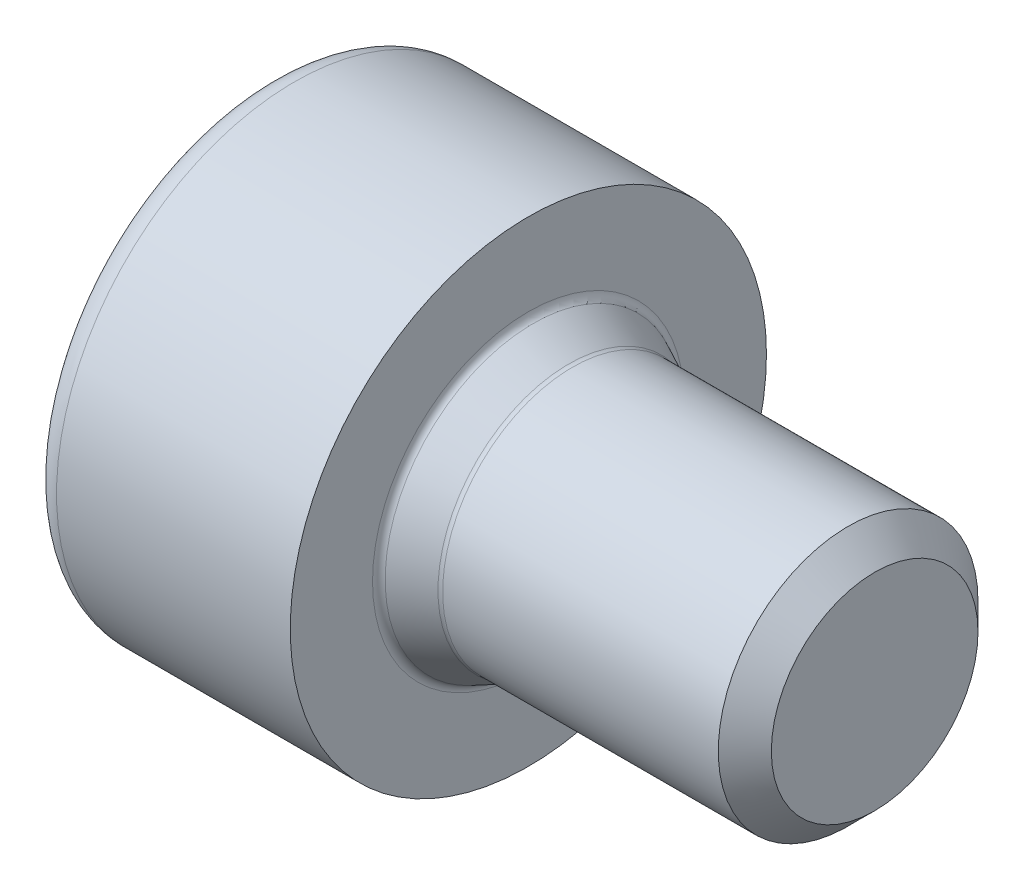
ISO-10303-21;
HEADER;
FILE_DESCRIPTION(('STEP AP214'),'2;1');
FILE_NAME('part.step','',(''),(''),'','','');
FILE_SCHEMA(('AUTOMOTIVE_DESIGN { 1 0 10303 214 1 1 1 1 }'));
ENDSEC;
DATA;
#1=APPLICATION_CONTEXT('core data for automotive mechanical design processes');
#2=APPLICATION_PROTOCOL_DEFINITION('international standard','automotive_design',2000,#1);
#3=PRODUCT_CONTEXT('',#1,'mechanical');
#4=PRODUCT('Part','Part','',(#3));
#5=PRODUCT_RELATED_PRODUCT_CATEGORY('part','',(#4));
#6=PRODUCT_DEFINITION_FORMATION('','',#4);
#7=PRODUCT_DEFINITION_CONTEXT('part definition',#1,'design');
#8=PRODUCT_DEFINITION('design','',#6,#7);
#9=PRODUCT_DEFINITION_SHAPE('','',#8);
#10=(LENGTH_UNIT() NAMED_UNIT(*) SI_UNIT(.MILLI.,.METRE.));
#11=(NAMED_UNIT(*) PLANE_ANGLE_UNIT() SI_UNIT($,.RADIAN.));
#12=(NAMED_UNIT(*) SI_UNIT($,.STERADIAN.) SOLID_ANGLE_UNIT());
#13=UNCERTAINTY_MEASURE_WITH_UNIT(LENGTH_MEASURE(1.E-05),#10,'distance_accuracy_value','');
#14=(GEOMETRIC_REPRESENTATION_CONTEXT(3) GLOBAL_UNCERTAINTY_ASSIGNED_CONTEXT((#13)) GLOBAL_UNIT_ASSIGNED_CONTEXT((#10,
#11,#12)) REPRESENTATION_CONTEXT('',''));
#15=CARTESIAN_POINT('',(0.,0.,0.));
#16=DIRECTION('',(0.,0.,1.));
#17=DIRECTION('',(1.,0.,0.));
#18=AXIS2_PLACEMENT_3D('',#15,#16,#17);
#19=CARTESIAN_POINT('',(-1.7,0.,0.));
#20=DIRECTION('',(-1.,0.,0.));
#21=DIRECTION('',(0.,0.,1.));
#22=AXIS2_PLACEMENT_3D('',#19,#20,#21);
#23=CONICAL_SURFACE('',#22,1.25,1.0471975511966);
#24=CARTESIAN_POINT('',(-1.7,0.,0.));
#25=DIRECTION('',(1.,0.,0.));
#26=DIRECTION('',(0.,0.,1.));
#27=AXIS2_PLACEMENT_3D('',#24,#25,#26);
#28=CIRCLE('',#27,1.25);
#29=CARTESIAN_POINT('',(-1.7,1.08253175473055,0.625));
#30=VERTEX_POINT('',#29);
#31=CARTESIAN_POINT('',(-1.7,0.,1.25));
#32=VERTEX_POINT('',#31);
#33=EDGE_CURVE('E11',#30,#32,#28,.T.);
#34=ORIENTED_EDGE('',*,*,#33,.F.);
#35=CARTESIAN_POINT('',(-1.7,0.,0.));
#36=DIRECTION('',(1.,0.,0.));
#37=DIRECTION('',(0.,0.,1.));
#38=AXIS2_PLACEMENT_3D('',#35,#36,#37);
#39=CIRCLE('',#38,1.25);
#40=CARTESIAN_POINT('',(-1.7,1.08253175473055,-0.625));
#41=VERTEX_POINT('',#40);
#42=EDGE_CURVE('E355',#41,#30,#39,.T.);
#43=ORIENTED_EDGE('',*,*,#42,.F.);
#44=CARTESIAN_POINT('',(-1.7,0.,0.));
#45=DIRECTION('',(1.,0.,0.));
#46=DIRECTION('',(0.,0.,1.));
#47=AXIS2_PLACEMENT_3D('',#44,#45,#46);
#48=CIRCLE('',#47,1.25);
#49=CARTESIAN_POINT('',(-1.7,0.,-1.25));
#50=VERTEX_POINT('',#49);
#51=EDGE_CURVE('E203',#50,#41,#48,.T.);
#52=ORIENTED_EDGE('',*,*,#51,.F.);
#53=CARTESIAN_POINT('',(-1.7,0.,0.));
#54=DIRECTION('',(1.,0.,0.));
#55=DIRECTION('',(0.,0.,1.));
#56=AXIS2_PLACEMENT_3D('',#53,#54,#55);
#57=CIRCLE('',#56,1.25);
#58=CARTESIAN_POINT('',(-1.7,-1.08253175473055,-0.625));
#59=VERTEX_POINT('',#58);
#60=EDGE_CURVE('E333',#59,#50,#57,.T.);
#61=ORIENTED_EDGE('',*,*,#60,.F.);
#62=CARTESIAN_POINT('',(-1.7,0.,0.));
#63=DIRECTION('',(1.,0.,0.));
#64=DIRECTION('',(0.,0.,1.));
#65=AXIS2_PLACEMENT_3D('',#62,#63,#64);
#66=CIRCLE('',#65,1.25);
#67=CARTESIAN_POINT('',(-1.7,-1.08253175473055,0.625));
#68=VERTEX_POINT('',#67);
#69=EDGE_CURVE('E189',#68,#59,#66,.T.);
#70=ORIENTED_EDGE('',*,*,#69,.F.);
#71=CARTESIAN_POINT('',(-1.7,0.,0.));
#72=DIRECTION('',(1.,0.,0.));
#73=DIRECTION('',(0.,0.,1.));
#74=AXIS2_PLACEMENT_3D('',#71,#72,#73);
#75=CIRCLE('',#74,1.25);
#76=EDGE_CURVE('E190',#32,#68,#75,.T.);
#77=ORIENTED_EDGE('',*,*,#76,.F.);
#78=EDGE_LOOP('',(#34,#43,#52,#61,#70,#77));
#79=FACE_BOUND('',#78,.T.);
#80=CARTESIAN_POINT('',(-0.978312163512968,0.,0.));
#81=VERTEX_POINT('',#80);
#82=VERTEX_LOOP('',#81);
#83=FACE_BOUND('',#82,.T.);
#84=ADVANCED_FACE('F16',(#79,#83),#23,.F.);
#85=CARTESIAN_POINT('',(-1.7,1.25,0.));
#86=DIRECTION('',(-1.,0.,0.));
#87=DIRECTION('',(0.,0.,1.));
#88=AXIS2_PLACEMENT_3D('',#85,#86,#87);
#89=PLANE('',#88);
#90=DIRECTION('',(0.,-0.5,0.866025403784439));
#91=VECTOR('',#90,1.);
#92=CARTESIAN_POINT('',(-1.7,1.44337567297406,0.));
#93=LINE('',#92,#91);
#94=CARTESIAN_POINT('',(-1.7,0.721687836487032,1.25));
#95=VERTEX_POINT('',#94);
#96=EDGE_CURVE('E29',#30,#95,#93,.T.);
#97=ORIENTED_EDGE('',*,*,#96,.F.);
#98=ORIENTED_EDGE('',*,*,#33,.T.);
#99=DIRECTION('',(0.,-1.,0.));
#100=VECTOR('',#99,1.);
#101=CARTESIAN_POINT('',(-1.7,0.721687836487032,1.25));
#102=LINE('',#101,#100);
#103=EDGE_CURVE('E306',#95,#32,#102,.T.);
#104=ORIENTED_EDGE('',*,*,#103,.F.);
#105=EDGE_LOOP('',(#97,#98,#104));
#106=FACE_BOUND('',#105,.T.);
#107=ADVANCED_FACE('F286',(#106),#89,.T.);
#108=CARTESIAN_POINT('',(-1.7,1.44337567297406,0.));
#109=DIRECTION('',(0.,-0.866025403784439,-0.5));
#110=DIRECTION('',(0.,0.5,-0.866025403784439));
#111=AXIS2_PLACEMENT_3D('',#108,#109,#110);
#112=PLANE('',#111);
#113=CARTESIAN_POINT('',(-2.99328869166182,1.44337567297301,-3.44121939592512E-13));
#114=CARTESIAN_POINT('',(-2.98433919425117,1.42787244875791,0.0268508818971255));
#115=CARTESIAN_POINT('',(-2.97578400285569,1.41230749394716,0.0538025056358081));
#116=CARTESIAN_POINT('',(-2.95983998482174,1.38155938839761,0.107121610863528));
#117=CARTESIAN_POINT('',(-2.9524239068139,1.36637875834845,0.133482423120639));
#118=CARTESIAN_POINT('',(-2.938754803639,1.33634492626375,0.185789430630884));
#119=CARTESIAN_POINT('',(-2.93247769848503,1.32149283356302,0.211729920605803));
#120=CARTESIAN_POINT('',(-2.92108320579471,1.29203467285119,0.263373144966651));
#121=CARTESIAN_POINT('',(-2.91594721851763,1.27742891496914,0.28907193215387));
#122=CARTESIAN_POINT('',(-2.90682859378075,1.24834944771762,0.340415342977566));
#123=CARTESIAN_POINT('',(-2.90283536127198,1.23387581621797,0.366058119756369));
#124=CARTESIAN_POINT('',(-2.89599346220477,1.20490951310166,0.417473894727208));
#125=CARTESIAN_POINT('',(-2.89314440428004,1.19041684969955,0.443246845333533));
#126=CARTESIAN_POINT('',(-2.88858006715933,1.16122057784381,0.49510268899029));
#127=CARTESIAN_POINT('',(-2.8868759639653,1.14651628162157,0.521186177701711));
#128=CARTESIAN_POINT('',(-2.88458951528671,1.11666112907707,0.573830738786405));
#129=CARTESIAN_POINT('',(-2.88403003999512,1.10150719454651,0.600391045600033));
#130=CARTESIAN_POINT('',(-2.88402227209633,1.07091834534289,0.653367110958168));
#131=CARTESIAN_POINT('',(-2.88457453092006,1.0554832949967,0.679782791249925));
#132=CARTESIAN_POINT('',(-2.88684880733001,1.02480053250358,0.731984265688699));
#133=CARTESIAN_POINT('',(-2.88854789719619,1.0095550043121,0.757772329002836));
#134=CARTESIAN_POINT('',(-2.89310421682754,0.979228002211919,0.809009713719137));
#135=CARTESIAN_POINT('',(-2.8959502638346,0.964146348562321,0.834459922342478));
#136=CARTESIAN_POINT('',(-2.9027881530019,0.934086589910349,0.885280119632192));
#137=CARTESIAN_POINT('',(-2.90678042658968,0.919108526076017,0.910650074449965));
#138=CARTESIAN_POINT('',(-2.91589908399277,0.889168164417571,0.961535182276744));
#139=CARTESIAN_POINT('',(-2.92103614189531,0.874207443006875,0.987049340550733));
#140=CARTESIAN_POINT('',(-2.93243469597692,0.84419571318469,1.03841623237226));
#141=CARTESIAN_POINT('',(-2.93871489678857,0.829147988836548,1.06426671342299));
#142=CARTESIAN_POINT('',(-2.95239208440605,0.798846847920806,1.11646858180921));
#143=CARTESIAN_POINT('',(-2.95981326756262,0.783597832546386,1.14281613419668));
#144=CARTESIAN_POINT('',(-2.97576940410644,0.752773525874617,1.1961475801594));
#145=CARTESIAN_POINT('',(-2.98433172589113,0.737202749052113,1.22312592101838));
#146=CARTESIAN_POINT('',(-2.99328869166212,0.721687836486593,1.24999999999964));
#147=B_SPLINE_CURVE_WITH_KNOTS('',3,(#113,#114,#115,#116,#117,#118,#119,#120,#121,#122,#123,
#124,#125,#126,#127,#128,#129,#130,#131,#132,#133,#134,#135,#136,#137,#138,#139,#140,#141,#142,
#143,#144,#145,#146),.UNSPECIFIED.,.F.,.F.,(4,2,2,2,2,2,2,2,2,2,2,2,2,2,2,2,4),(0.,
0.0968162754331925,0.190733973282716,0.282346376228121,0.372333398873343,0.461456868309619,
0.550549826936639,0.640500263553455,0.732231061804305,0.824007370633263,0.914001173368636,
1.00313798737456,1.0923083956136,1.18234788001947,1.27402046187576,1.3680079512467,
1.46490521218937),.UNSPECIFIED.);
#148=CARTESIAN_POINT('',(-2.99328869166243,1.44337567297406,0.));
#149=VERTEX_POINT('',#148);
#150=CARTESIAN_POINT('',(-2.99328869166243,0.721687836487032,1.25));
#151=VERTEX_POINT('',#150);
#152=EDGE_CURVE('E269',#149,#151,#147,.T.);
#153=ORIENTED_EDGE('',*,*,#152,.F.);
#154=DIRECTION('',(-1.,0.,0.));
#155=VECTOR('',#154,1.);
#156=CARTESIAN_POINT('',(-1.7,1.44337567297406,0.));
#157=LINE('',#156,#155);
#158=CARTESIAN_POINT('',(-1.7,1.44337567297406,0.));
#159=VERTEX_POINT('',#158);
#160=EDGE_CURVE('E274',#159,#149,#157,.T.);
#161=ORIENTED_EDGE('',*,*,#160,.F.);
#162=DIRECTION('',(0.,-0.5,0.866025403784439));
#163=VECTOR('',#162,1.);
#164=CARTESIAN_POINT('',(-1.7,1.44337567297406,0.));
#165=LINE('',#164,#163);
#166=EDGE_CURVE('E352',#159,#30,#165,.T.);
#167=ORIENTED_EDGE('',*,*,#166,.T.);
#168=ORIENTED_EDGE('',*,*,#96,.T.);
#169=DIRECTION('',(-1.,0.,0.));
#170=VECTOR('',#169,1.);
#171=CARTESIAN_POINT('',(-1.7,0.721687836487032,1.25));
#172=LINE('',#171,#170);
#173=EDGE_CURVE('E299',#95,#151,#172,.T.);
#174=ORIENTED_EDGE('',*,*,#173,.T.);
#175=EDGE_LOOP('',(#153,#161,#167,#168,#174));
#176=FACE_BOUND('',#175,.T.);
#177=ADVANCED_FACE('F276',(#176),#112,.T.);
#178=CARTESIAN_POINT('',(-1.7,0.721687836487032,-1.25));
#179=DIRECTION('',(0.,-0.866025403784439,0.5));
#180=DIRECTION('',(-1.,0.,0.));
#181=AXIS2_PLACEMENT_3D('',#178,#179,#180);
#182=PLANE('',#181);
#183=CARTESIAN_POINT('',(-2.99328869166182,0.721687836486206,-1.24999999999926));
#184=CARTESIAN_POINT('',(-2.9843391942512,0.737189770215845,-1.22314837303975));
#185=CARTESIAN_POINT('',(-2.97578400285574,0.752748083641374,-1.19619291489561));
#186=CARTESIAN_POINT('',(-2.95983998482183,0.783549730500816,-1.14290472175772));
#187=CARTESIAN_POINT('',(-2.952423906814,0.798788548555271,-1.11657750436119));
#188=CARTESIAN_POINT('',(-2.93875480363913,0.829070829812726,-1.0644139390478));
#189=CARTESIAN_POINT('',(-2.93247769848517,0.844109906767254,-1.03858140448218));
#190=CARTESIAN_POINT('',(-2.92108320579486,0.874105170641184,-0.987248276776588));
#191=CARTESIAN_POINT('',(-2.91594721851778,0.88905809425075,-0.96174992581561));
#192=CARTESIAN_POINT('',(-2.90682859378091,0.918983058715277,-0.91089466303543));
#193=CARTESIAN_POINT('',(-2.90283536127213,0.933953539079481,-0.885538742082304));
#194=CARTESIAN_POINT('',(-2.89599346220491,0.963997754801369,-0.834745300244403));
#195=CARTESIAN_POINT('',(-2.89314440428016,0.97907145305589,-0.809307810266489));
#196=CARTESIAN_POINT('',(-2.88858006715943,1.00938179506947,-0.758095175315156));
#197=CARTESIAN_POINT('',(-2.88687596396539,1.02461861080177,-0.732319136886165));
#198=CARTESIAN_POINT('',(-2.88458951528676,1.05528256179996,-0.6801415358063));
#199=CARTESIAN_POINT('',(-2.88403003999514,1.07070749496759,-0.653737690128665));
#200=CARTESIAN_POINT('',(-2.88402227209631,1.1012916887584,-0.60075893696669));
#201=CARTESIAN_POINT('',(-2.88457453092001,1.11645081377615,-0.57418395111235));
#202=CARTESIAN_POINT('',(-2.88684880732993,1.14631723550847,-0.521511162115704));
#203=CARTESIAN_POINT('',(-2.88854789719608,1.16102758935714,-0.495414115750742));
#204=CARTESIAN_POINT('',(-2.89310421682742,1.19023696509479,-0.44353146915327));
#205=CARTESIAN_POINT('',(-2.89595026383446,1.20473666546939,-0.417745269649997));
#206=CARTESIAN_POINT('',(-2.90278815300175,1.23371836802162,-0.366302656380948));
#207=CARTESIAN_POINT('',(-2.90678042658952,1.24820036146951,-0.340646295192042));
#208=CARTESIAN_POINT('',(-2.91589908399261,1.2772979766926,-0.289274627483964));
#209=CARTESIAN_POINT('',(-2.92103614189516,1.29191352520872,-0.263561183546368));
#210=CARTESIAN_POINT('',(-2.93243469597678,1.32139269352855,-0.211886817198067));
#211=CARTESIAN_POINT('',(-2.93871489678844,1.33625600464449,-0.185929865118048));
#212=CARTESIAN_POINT('',(-2.95239208440595,1.36631357833417,-0.133587373128199));
#213=CARTESIAN_POINT('',(-2.95981326756254,1.38150672034208,-0.107207562237482));
#214=CARTESIAN_POINT('',(-2.97576940410639,1.41228095403055,-0.0538472066242273));
#215=CARTESIAN_POINT('',(-2.98433172589111,1.42785949415517,-0.0268733479097287));
#216=CARTESIAN_POINT('',(-2.99328869166212,1.44337567297354,2.04563413588605E-13));
#217=B_SPLINE_CURVE_WITH_KNOTS('',3,(#183,#184,#185,#186,#187,#188,#189,#190,#191,#192,#193,
#194,#195,#196,#197,#198,#199,#200,#201,#202,#203,#204,#205,#206,#207,#208,#209,#210,#211,#212,
#213,#214,#215,#216),.UNSPECIFIED.,.F.,.F.,(4,2,2,2,2,2,2,2,2,2,2,2,2,2,2,2,4),(0.,
0.0968162754329548,0.190733973282319,0.282346376227639,0.372333398872846,0.46145686830917,
0.550549826936293,0.640500263553258,0.732231061804296,0.824007370633069,0.914001173368293,
1.00313798737411,1.09230839561311,1.18234788001899,1.27402046187537,1.36800795124647,
1.46490521218938),.UNSPECIFIED.);
#218=CARTESIAN_POINT('',(-2.99328869166243,0.721687836487032,-1.25));
#219=VERTEX_POINT('',#218);
#220=EDGE_CURVE('E354',#219,#149,#217,.T.);
#221=ORIENTED_EDGE('',*,*,#220,.F.);
#222=DIRECTION('',(-1.,0.,0.));
#223=VECTOR('',#222,1.);
#224=CARTESIAN_POINT('',(-1.7,0.721687836487032,-1.25));
#225=LINE('',#224,#223);
#226=CARTESIAN_POINT('',(-1.7,0.721687836487032,-1.25));
#227=VERTEX_POINT('',#226);
#228=EDGE_CURVE('E401',#227,#219,#225,.T.);
#229=ORIENTED_EDGE('',*,*,#228,.F.);
#230=DIRECTION('',(0.,0.5,0.866025403784439));
#231=VECTOR('',#230,1.);
#232=CARTESIAN_POINT('',(-1.7,0.721687836487032,-1.25));
#233=LINE('',#232,#231);
#234=EDGE_CURVE('E330',#227,#41,#233,.T.);
#235=ORIENTED_EDGE('',*,*,#234,.T.);
#236=DIRECTION('',(0.,0.5,0.866025403784439));
#237=VECTOR('',#236,1.);
#238=CARTESIAN_POINT('',(-1.7,0.721687836487032,-1.25));
#239=LINE('',#238,#237);
#240=EDGE_CURVE('E359',#41,#159,#239,.T.);
#241=ORIENTED_EDGE('',*,*,#240,.T.);
#242=ORIENTED_EDGE('',*,*,#160,.T.);
#243=EDGE_LOOP('',(#221,#229,#235,#241,#242));
#244=FACE_BOUND('',#243,.T.);
#245=ADVANCED_FACE('F285',(#244),#182,.T.);
#246=CARTESIAN_POINT('',(-1.7,-0.721687836487032,-1.25));
#247=DIRECTION('',(0.,0.,1.));
#248=DIRECTION('',(1.,0.,0.));
#249=AXIS2_PLACEMENT_3D('',#246,#247,#248);
#250=PLANE('',#249);
#251=CARTESIAN_POINT('',(-2.99328869166243,-0.721687836487035,-1.25));
#252=CARTESIAN_POINT('',(-2.98434132298847,-0.690690206622635,-1.24999920510765));
#253=CARTESIAN_POINT('',(-2.97578923469051,-0.65957418341172,-1.24999777787213));
#254=CARTESIAN_POINT('',(-2.959851513021,-0.598033118262734,-1.2500372365912));
#255=CARTESIAN_POINT('',(-2.95243873309767,-0.567615083364684,-1.2500768641148));
#256=CARTESIAN_POINT('',(-2.93877632736963,-0.507295872598636,-1.25023490819173));
#257=CARTESIAN_POINT('',(-2.93250276666777,-0.477400155529278,-1.25035138200167));
#258=CARTESIAN_POINT('',(-2.92111540799237,-0.417931593841695,-1.25067980710384));
#259=CARTESIAN_POINT('',(-2.91598319918292,-0.388362282477519,-1.25089004802875));
#260=CARTESIAN_POINT('',(-2.90687213774906,-0.329330408262962,-1.251397879646));
#261=CARTESIAN_POINT('',(-2.90288291708311,-0.299869446222123,-1.25169463240332));
#262=CARTESIAN_POINT('',(-2.89604900902002,-0.240818892136124,-1.25233558601959));
#263=CARTESIAN_POINT('',(-2.89320418229112,-0.211229316193588,-1.25267978109551));
#264=CARTESIAN_POINT('',(-2.88864827038569,-0.151669791248626,-1.25333802377296));
#265=CARTESIAN_POINT('',(-2.88694861898355,-0.121698964795187,-1.25365174132491));
#266=CARTESIAN_POINT('',(-2.88467098909343,-0.0611138274985406,-1.25412734795474));
#267=CARTESIAN_POINT('',(-2.88411612218051,-0.0304986344841638,-1.25428607521707));
#268=CARTESIAN_POINT('',(-2.88411757190717,0.0307163915898451,-1.25428289805592));
#269=CARTESIAN_POINT('',(-2.88467333265578,0.0613162246696366,-1.25412115403497));
#270=CARTESIAN_POINT('',(-2.88695263117183,0.121872462649902,-1.2536415421792));
#271=CARTESIAN_POINT('',(-2.88865311995598,0.151829748202004,-1.25332678927562));
#272=CARTESIAN_POINT('',(-2.89321027246486,0.211363913631353,-1.25266748914971));
#273=CARTESIAN_POINT('',(-2.89605557036552,0.240941666292512,-1.25232326027351));
#274=CARTESIAN_POINT('',(-2.90289006984522,0.299970188490019,-1.25168298586433));
#275=CARTESIAN_POINT('',(-2.90687947296951,0.329420934724307,-1.25138694883523));
#276=CARTESIAN_POINT('',(-2.91599053450067,0.388433884949801,-1.25088090746324));
#277=CARTESIAN_POINT('',(-2.92112261382891,0.417994479434238,-1.25067174927762));
#278=CARTESIAN_POINT('',(-2.93250936621469,0.47744701500882,-1.250345548277));
#279=CARTESIAN_POINT('',(-2.93878249142805,0.507335414068867,-1.25023022156606));
#280=CARTESIAN_POINT('',(-2.95244368731704,0.567641308626605,-1.25007423805541));
#281=CARTESIAN_POINT('',(-2.95985572208406,0.598053337836266,-1.25003552120292));
#282=CARTESIAN_POINT('',(-2.97579163747977,0.659583631975224,-1.24999738859105));
#283=CARTESIAN_POINT('',(-2.98434268337241,0.690694884578307,-1.24999921696783));
#284=CARTESIAN_POINT('',(-2.99328869166242,0.721687836487032,-1.24999999999999));
#285=B_SPLINE_CURVE_WITH_KNOTS('',3,(#251,#252,#253,#254,#255,#256,#257,#258,#259,#260,#261,
#262,#263,#264,#265,#266,#267,#268,#269,#270,#271,#272,#273,#274,#275,#276,#277,#278,#279,#280,
#281,#282,#283,#284),.UNSPECIFIED.,.F.,.F.,(4,2,2,2,2,2,2,2,2,2,2,2,2,2,2,2,4),(0.,
0.0967927937721565,0.19070399219288,0.282327598411883,0.372344256389515,0.461516463179881,
0.550677809826358,0.640716676901424,0.732556189340511,0.824349745812092,0.914348234383848,
1.00347442419992,1.09261632411497,1.1826071428866,1.27420899837472,1.36810217596061,
1.46488035741199),.UNSPECIFIED.);
#286=CARTESIAN_POINT('',(-2.99328869166243,-0.721687836487032,-1.25));
#287=VERTEX_POINT('',#286);
#288=EDGE_CURVE('E179',#287,#219,#285,.T.);
#289=ORIENTED_EDGE('',*,*,#288,.F.);
#290=DIRECTION('',(-1.,0.,0.));
#291=VECTOR('',#290,1.);
#292=CARTESIAN_POINT('',(-1.7,-0.721687836487032,-1.25));
#293=LINE('',#292,#291);
#294=CARTESIAN_POINT('',(-1.7,-0.721687836487032,-1.25));
#295=VERTEX_POINT('',#294);
#296=EDGE_CURVE('E398',#295,#287,#293,.T.);
#297=ORIENTED_EDGE('',*,*,#296,.F.);
#298=DIRECTION('',(0.,1.,0.));
#299=VECTOR('',#298,1.);
#300=CARTESIAN_POINT('',(-1.7,-0.721687836487032,-1.25));
#301=LINE('',#300,#299);
#302=EDGE_CURVE('E204',#295,#50,#301,.T.);
#303=ORIENTED_EDGE('',*,*,#302,.T.);
#304=DIRECTION('',(0.,1.,0.));
#305=VECTOR('',#304,1.);
#306=CARTESIAN_POINT('',(-1.7,-0.721687836487032,-1.25));
#307=LINE('',#306,#305);
#308=EDGE_CURVE('E199',#50,#227,#307,.T.);
#309=ORIENTED_EDGE('',*,*,#308,.T.);
#310=ORIENTED_EDGE('',*,*,#228,.T.);
#311=EDGE_LOOP('',(#289,#297,#303,#309,#310));
#312=FACE_BOUND('',#311,.T.);
#313=ADVANCED_FACE('F450',(#312),#250,.T.);
#314=CARTESIAN_POINT('',(-1.7,-1.44337567297406,0.));
#315=DIRECTION('',(0.,0.866025403784439,0.5));
#316=DIRECTION('',(1.,0.,0.));
#317=AXIS2_PLACEMENT_3D('',#314,#315,#316);
#318=PLANE('',#317);
#319=CARTESIAN_POINT('',(-2.99328869166182,-1.44337567297301,3.47150114863362E-13));
#320=CARTESIAN_POINT('',(-2.98433919425117,-1.42787244875791,-0.026850881897122));
#321=CARTESIAN_POINT('',(-2.97578400285569,-1.41230749394716,-0.0538025056358042));
#322=CARTESIAN_POINT('',(-2.95983998482174,-1.38155938839761,-0.107121610863524));
#323=CARTESIAN_POINT('',(-2.9524239068139,-1.36637875834845,-0.133482423120635));
#324=CARTESIAN_POINT('',(-2.938754803639,-1.33634492626375,-0.185789430630881));
#325=CARTESIAN_POINT('',(-2.93247769848504,-1.32149283356302,-0.211729920605801));
#326=CARTESIAN_POINT('',(-2.92108320579471,-1.29203467285119,-0.263373144966649));
#327=CARTESIAN_POINT('',(-2.91594721851763,-1.27742891496914,-0.289071932153867));
#328=CARTESIAN_POINT('',(-2.90682859378075,-1.24834944771762,-0.340415342977564));
#329=CARTESIAN_POINT('',(-2.90283536127198,-1.23387581621797,-0.366058119756367));
#330=CARTESIAN_POINT('',(-2.89599346220477,-1.20490951310166,-0.417473894727207));
#331=CARTESIAN_POINT('',(-2.89314440428004,-1.19041684969956,-0.443246845333533));
#332=CARTESIAN_POINT('',(-2.88858006715933,-1.16122057784381,-0.495102688990291));
#333=CARTESIAN_POINT('',(-2.8868759639653,-1.14651628162157,-0.521186177701712));
#334=CARTESIAN_POINT('',(-2.88458951528671,-1.11666112907707,-0.573830738786407));
#335=CARTESIAN_POINT('',(-2.88403003999512,-1.10150719454651,-0.600391045600035));
#336=CARTESIAN_POINT('',(-2.88402227209633,-1.07091834534289,-0.65336711095817));
#337=CARTESIAN_POINT('',(-2.88457453092006,-1.0554832949967,-0.679782791249928));
#338=CARTESIAN_POINT('',(-2.88684880733001,-1.02480053250357,-0.731984265688702));
#339=CARTESIAN_POINT('',(-2.88854789719619,-1.0095550043121,-0.757772329002839));
#340=CARTESIAN_POINT('',(-2.89310421682754,-0.979228002211917,-0.80900971371914));
#341=CARTESIAN_POINT('',(-2.8959502638346,-0.964146348562319,-0.83445992234248));
#342=CARTESIAN_POINT('',(-2.9027881530019,-0.934086589910348,-0.885280119632193));
#343=CARTESIAN_POINT('',(-2.90678042658968,-0.919108526076016,-0.910650074449966));
#344=CARTESIAN_POINT('',(-2.91589908399277,-0.88916816441757,-0.961535182276744));
#345=CARTESIAN_POINT('',(-2.92103614189531,-0.874207443006875,-0.987049340550733));
#346=CARTESIAN_POINT('',(-2.93243469597692,-0.84419571318469,-1.03841623237226));
#347=CARTESIAN_POINT('',(-2.93871489678857,-0.829147988836548,-1.06426671342299));
#348=CARTESIAN_POINT('',(-2.95239208440605,-0.798846847920807,-1.11646858180921));
#349=CARTESIAN_POINT('',(-2.95981326756262,-0.783597832546388,-1.14281613419668));
#350=CARTESIAN_POINT('',(-2.97576940410644,-0.752773525874619,-1.1961475801594));
#351=CARTESIAN_POINT('',(-2.98433172589113,-0.737202749052116,-1.22312592101838));
#352=CARTESIAN_POINT('',(-2.99328869166212,-0.721687836486597,-1.24999999999964));
#353=B_SPLINE_CURVE_WITH_KNOTS('',3,(#319,#320,#321,#322,#323,#324,#325,#326,#327,#328,#329,
#330,#331,#332,#333,#334,#335,#336,#337,#338,#339,#340,#341,#342,#343,#344,#345,#346,#347,#348,
#349,#350,#351,#352),.UNSPECIFIED.,.F.,.F.,(4,2,2,2,2,2,2,2,2,2,2,2,2,2,2,2,4),(0.,
0.0968162754331914,0.190733973282715,0.282346376228121,0.372333398873344,0.46145686830962,
0.550549826936642,0.640500263553458,0.73223106180431,0.824007370633269,0.914001173368642,
1.00313798737456,1.0923083956136,1.18234788001947,1.27402046187576,1.3680079512467,
1.46490521218937),.UNSPECIFIED.);
#354=CARTESIAN_POINT('',(-2.99328869166243,-1.44337567297406,0.));
#355=VERTEX_POINT('',#354);
#356=EDGE_CURVE('E394',#355,#287,#353,.T.);
#357=ORIENTED_EDGE('',*,*,#356,.F.);
#358=DIRECTION('',(-1.,0.,0.));
#359=VECTOR('',#358,1.);
#360=CARTESIAN_POINT('',(-1.7,-1.44337567297406,0.));
#361=LINE('',#360,#359);
#362=CARTESIAN_POINT('',(-1.7,-1.44337567297406,0.));
#363=VERTEX_POINT('',#362);
#364=EDGE_CURVE('E393',#363,#355,#361,.T.);
#365=ORIENTED_EDGE('',*,*,#364,.F.);
#366=DIRECTION('',(0.,0.5,-0.866025403784439));
#367=VECTOR('',#366,1.);
#368=CARTESIAN_POINT('',(-1.7,-1.44337567297406,0.));
#369=LINE('',#368,#367);
#370=EDGE_CURVE('E185',#363,#59,#369,.T.);
#371=ORIENTED_EDGE('',*,*,#370,.T.);
#372=DIRECTION('',(0.,0.5,-0.866025403784439));
#373=VECTOR('',#372,1.);
#374=CARTESIAN_POINT('',(-1.7,-1.44337567297406,0.));
#375=LINE('',#374,#373);
#376=EDGE_CURVE('E188',#59,#295,#375,.T.);
#377=ORIENTED_EDGE('',*,*,#376,.T.);
#378=ORIENTED_EDGE('',*,*,#296,.T.);
#379=EDGE_LOOP('',(#357,#365,#371,#377,#378));
#380=FACE_BOUND('',#379,.T.);
#381=ADVANCED_FACE('F392',(#380),#318,.T.);
#382=CARTESIAN_POINT('',(-1.7,-0.721687836487032,1.25));
#383=DIRECTION('',(0.,0.866025403784439,-0.5));
#384=DIRECTION('',(-1.,0.,0.));
#385=AXIS2_PLACEMENT_3D('',#382,#383,#384);
#386=PLANE('',#385);
#387=CARTESIAN_POINT('',(-2.99328869166182,-0.721687836486204,1.24999999999926));
#388=CARTESIAN_POINT('',(-2.9843391942512,-0.737189770215843,1.22314837303976));
#389=CARTESIAN_POINT('',(-2.97578400285574,-0.752748083641372,1.19619291489561));
#390=CARTESIAN_POINT('',(-2.95983998482183,-0.783549730500815,1.14290472175772));
#391=CARTESIAN_POINT('',(-2.952423906814,-0.79878854855527,1.11657750436119));
#392=CARTESIAN_POINT('',(-2.93875480363913,-0.829070829812726,1.0644139390478));
#393=CARTESIAN_POINT('',(-2.93247769848517,-0.844109906767255,1.03858140448218));
#394=CARTESIAN_POINT('',(-2.92108320579486,-0.874105170641184,0.987248276776588));
#395=CARTESIAN_POINT('',(-2.91594721851778,-0.88905809425075,0.96174992581561));
#396=CARTESIAN_POINT('',(-2.90682859378091,-0.918983058715276,0.91089466303543));
#397=CARTESIAN_POINT('',(-2.90283536127213,-0.93395353907948,0.885538742082305));
#398=CARTESIAN_POINT('',(-2.89599346220491,-0.963997754801367,0.834745300244404));
#399=CARTESIAN_POINT('',(-2.89314440428016,-0.979071453055888,0.809307810266491));
#400=CARTESIAN_POINT('',(-2.88858006715943,-1.00938179506946,0.758095175315159));
#401=CARTESIAN_POINT('',(-2.88687596396539,-1.02461861080177,0.732319136886169));
#402=CARTESIAN_POINT('',(-2.88458951528676,-1.05528256179996,0.680141535806306));
#403=CARTESIAN_POINT('',(-2.88403003999514,-1.07070749496759,0.653737690128672));
#404=CARTESIAN_POINT('',(-2.88402227209631,-1.1012916887584,0.600758936966696));
#405=CARTESIAN_POINT('',(-2.88457453092001,-1.11645081377615,0.574183951112356));
#406=CARTESIAN_POINT('',(-2.88684880732993,-1.14631723550847,0.521511162115708));
#407=CARTESIAN_POINT('',(-2.88854789719608,-1.16102758935714,0.495414115750746));
#408=CARTESIAN_POINT('',(-2.89310421682742,-1.19023696509478,0.443531469153273));
#409=CARTESIAN_POINT('',(-2.89595026383446,-1.20473666546939,0.417745269649999));
#410=CARTESIAN_POINT('',(-2.90278815300175,-1.23371836802162,0.366302656380949));
#411=CARTESIAN_POINT('',(-2.90678042658952,-1.24820036146951,0.340646295192043));
#412=CARTESIAN_POINT('',(-2.91589908399261,-1.2772979766926,0.289274627483965));
#413=CARTESIAN_POINT('',(-2.92103614189516,-1.29191352520872,0.263561183546368));
#414=CARTESIAN_POINT('',(-2.93243469597678,-1.32139269352855,0.211886817198067));
#415=CARTESIAN_POINT('',(-2.93871489678844,-1.33625600464449,0.185929865118048));
#416=CARTESIAN_POINT('',(-2.95239208440595,-1.36631357833417,0.1335873731282));
#417=CARTESIAN_POINT('',(-2.95981326756254,-1.38150672034208,0.107207562237482));
#418=CARTESIAN_POINT('',(-2.97576940410639,-1.41228095403055,0.0538472066242286));
#419=CARTESIAN_POINT('',(-2.98433172589111,-1.42785949415517,0.0268733479097307));
#420=CARTESIAN_POINT('',(-2.99328869166212,-1.44337567297354,-2.01535238317754E-13));
#421=B_SPLINE_CURVE_WITH_KNOTS('',3,(#387,#388,#389,#390,#391,#392,#393,#394,#395,#396,#397,
#398,#399,#400,#401,#402,#403,#404,#405,#406,#407,#408,#409,#410,#411,#412,#413,#414,#415,#416,
#417,#418,#419,#420),.UNSPECIFIED.,.F.,.F.,(4,2,2,2,2,2,2,2,2,2,2,2,2,2,2,2,4),(0.,
0.0968162754329555,0.190733973282321,0.282346376227641,0.372333398872848,0.461456868309171,
0.550549826936292,0.640500263553255,0.73223106180429,0.824007370633066,0.914001173368292,
1.00313798737411,1.09230839561311,1.182347880019,1.27402046187537,1.36800795124647,
1.46490521218938),.UNSPECIFIED.);
#422=CARTESIAN_POINT('',(-2.99328869166243,-0.721687836487032,1.25));
#423=VERTEX_POINT('',#422);
#424=EDGE_CURVE('E412',#423,#355,#421,.T.);
#425=ORIENTED_EDGE('',*,*,#424,.F.);
#426=DIRECTION('',(-1.,0.,0.));
#427=VECTOR('',#426,1.);
#428=CARTESIAN_POINT('',(-1.7,-0.721687836487032,1.25));
#429=LINE('',#428,#427);
#430=CARTESIAN_POINT('',(-1.7,-0.721687836487032,1.25));
#431=VERTEX_POINT('',#430);
#432=EDGE_CURVE('E315',#431,#423,#429,.T.);
#433=ORIENTED_EDGE('',*,*,#432,.F.);
#434=DIRECTION('',(0.,-0.5,-0.866025403784439));
#435=VECTOR('',#434,1.);
#436=CARTESIAN_POINT('',(-1.7,-0.721687836487032,1.25));
#437=LINE('',#436,#435);
#438=EDGE_CURVE('E194',#431,#68,#437,.T.);
#439=ORIENTED_EDGE('',*,*,#438,.T.);
#440=DIRECTION('',(0.,-0.5,-0.866025403784439));
#441=VECTOR('',#440,1.);
#442=CARTESIAN_POINT('',(-1.7,-0.721687836487032,1.25));
#443=LINE('',#442,#441);
#444=EDGE_CURVE('E362',#68,#363,#443,.T.);
#445=ORIENTED_EDGE('',*,*,#444,.T.);
#446=ORIENTED_EDGE('',*,*,#364,.T.);
#447=EDGE_LOOP('',(#425,#433,#439,#445,#446));
#448=FACE_BOUND('',#447,.T.);
#449=ADVANCED_FACE('F292',(#448),#386,.T.);
#450=CARTESIAN_POINT('',(-1.7,0.721687836487032,1.25));
#451=DIRECTION('',(0.,0.,-1.));
#452=DIRECTION('',(0.,-1.,0.));
#453=AXIS2_PLACEMENT_3D('',#450,#451,#452);
#454=PLANE('',#453);
#455=CARTESIAN_POINT('',(-2.99328869166243,0.721687836487032,1.25));
#456=CARTESIAN_POINT('',(-2.98434149440339,0.690690769906094,1.24999921480809));
#457=CARTESIAN_POINT('',(-2.97578939109021,0.659575362537188,1.24999744080739));
#458=CARTESIAN_POINT('',(-2.95985166820689,0.598036730555909,1.2500357677669));
#459=CARTESIAN_POINT('',(-2.95243887685379,0.567620519788745,1.25007462209937));
#460=CARTESIAN_POINT('',(-2.93877647402996,0.50730615985747,1.25023093821159));
#461=CARTESIAN_POINT('',(-2.93250289520351,0.477413477435431,1.25034645893313));
#462=CARTESIAN_POINT('',(-2.92111553745473,0.417952188878874,1.25067306301628));
#463=CARTESIAN_POINT('',(-2.91598330799337,0.388387124121365,1.25088243066874));
#464=CARTESIAN_POINT('',(-2.90687224411701,0.329364951594492,1.25138885162454));
#465=CARTESIAN_POINT('',(-2.9028829966022,0.299909451869866,1.25168506004407));
#466=CARTESIAN_POINT('',(-2.89604909467974,0.240871036506211,1.25232555160346));
#467=CARTESIAN_POINT('',(-2.89320425343994,0.211288142462862,1.25266982688371));
#468=CARTESIAN_POINT('',(-2.88864831224409,0.151743198212086,1.25332902322811));
#469=CARTESIAN_POINT('',(-2.88694859943224,0.121780273965757,1.25364362345776));
#470=CARTESIAN_POINT('',(-2.8846710744452,0.061212151608557,1.25412247836807));
#471=CARTESIAN_POINT('',(-2.88411633623592,0.0306060726927878,1.25428360631308));
#472=CARTESIAN_POINT('',(-2.88411738283913,-0.0306089600314313,1.25428541964366));
#473=CARTESIAN_POINT('',(-2.88467327242191,-0.061217913838707,1.25412607479766));
#474=CARTESIAN_POINT('',(-2.88695267586246,-0.121791178303871,1.25364970744475));
#475=CARTESIAN_POINT('',(-2.88865310306402,-0.151756370984324,1.25333583493459));
#476=CARTESIAN_POINT('',(-2.89321022563553,-0.211305125150264,1.25267748331847));
#477=CARTESIAN_POINT('',(-2.89605550848605,-0.2408895628384,1.25233333176219));
#478=CARTESIAN_POINT('',(-2.90289001275018,-0.299930228107621,1.25169258927677));
#479=CARTESIAN_POINT('',(-2.9068793881382,-0.329386437889465,1.25139600475768));
#480=CARTESIAN_POINT('',(-2.91599044517208,-0.388409090259692,1.25088854648394));
#481=CARTESIAN_POINT('',(-2.92112250261291,-0.417973930588944,1.25067851192655));
#482=CARTESIAN_POINT('',(-2.9325092531701,-0.477433735672064,1.25035048410746));
#483=CARTESIAN_POINT('',(-2.9387823586771,-0.507325166532514,1.25023420160882));
#484=CARTESIAN_POINT('',(-2.95244355401824,-0.567635904049215,1.2500764854911));
#485=CARTESIAN_POINT('',(-2.95985557543204,-0.598049752374271,1.25003699352262));
#486=CARTESIAN_POINT('',(-2.97579148545451,-0.659582467403317,1.24999772641441));
#487=CARTESIAN_POINT('',(-2.98434251405195,-0.690694328598187,1.24999920725177));
#488=CARTESIAN_POINT('',(-2.99328869166242,-0.721687836487029,1.24999999999999));
#489=B_SPLINE_CURVE_WITH_KNOTS('',3,(#455,#456,#457,#458,#459,#460,#461,#462,#463,#464,#465,
#466,#467,#468,#469,#470,#471,#472,#473,#474,#475,#476,#477,#478,#479,#480,#481,#482,#483,#484,
#485,#486,#487,#488),.UNSPECIFIED.,.F.,.F.,(4,2,2,2,2,2,2,2,2,2,2,2,2,2,2,2,4),(0.,
0.0967910320596595,0.190696928303273,0.282311632452064,0.372315735819741,0.4614716995194,
0.550613101985404,0.64062833457949,0.732440548194664,0.824261423259314,0.914283561042139,
1.0034297042701,1.0925878506108,1.18259122110748,1.27420196931197,1.36810043306758,
1.46488035343523),.UNSPECIFIED.);
#490=EDGE_CURVE('E413',#151,#423,#489,.T.);
#491=ORIENTED_EDGE('',*,*,#490,.F.);
#492=ORIENTED_EDGE('',*,*,#173,.F.);
#493=ORIENTED_EDGE('',*,*,#103,.T.);
#494=DIRECTION('',(0.,-1.,0.));
#495=VECTOR('',#494,1.);
#496=CARTESIAN_POINT('',(-1.7,0.721687836487032,1.25));
#497=LINE('',#496,#495);
#498=EDGE_CURVE('E195',#32,#431,#497,.T.);
#499=ORIENTED_EDGE('',*,*,#498,.T.);
#500=ORIENTED_EDGE('',*,*,#432,.T.);
#501=EDGE_LOOP('',(#491,#492,#493,#499,#500));
#502=FACE_BOUND('',#501,.T.);
#503=ADVANCED_FACE('F289',(#502),#454,.T.);
#504=CARTESIAN_POINT('',(-3.,0.,0.));
#505=DIRECTION('',(1.,0.,0.));
#506=DIRECTION('',(0.,1.,0.));
#507=AXIS2_PLACEMENT_3D('',#504,#505,#506);
#508=PLANE('',#507);
#509=CARTESIAN_POINT('',(-3.,0.,0.));
#510=DIRECTION('',(-1.,0.,0.));
#511=DIRECTION('',(0.,0.,-1.));
#512=AXIS2_PLACEMENT_3D('',#509,#510,#511);
#513=CIRCLE('',#512,1.455);
#514=CARTESIAN_POINT('',(-3.,0.,-1.455));
#515=VERTEX_POINT('',#514);
#516=EDGE_CURVE('E170',#515,#515,#513,.T.);
#517=ORIENTED_EDGE('',*,*,#516,.F.);
#518=EDGE_LOOP('',(#517));
#519=FACE_BOUND('',#518,.T.);
#520=CARTESIAN_POINT('',(-3.,0.,0.));
#521=DIRECTION('',(1.,0.,0.));
#522=DIRECTION('',(0.,0.,-1.));
#523=AXIS2_PLACEMENT_3D('',#520,#521,#522);
#524=CIRCLE('',#523,2.45);
#525=CARTESIAN_POINT('',(-3.,0.,-2.45));
#526=VERTEX_POINT('',#525);
#527=EDGE_CURVE('E307',#526,#526,#524,.T.);
#528=ORIENTED_EDGE('',*,*,#527,.F.);
#529=EDGE_LOOP('',(#528));
#530=FACE_BOUND('',#529,.T.);
#531=ADVANCED_FACE('F18',(#519,#530),#508,.F.);
#532=CARTESIAN_POINT('',(-2.7,0.,0.));
#533=DIRECTION('',(1.,0.,0.));
#534=DIRECTION('',(0.,0.,-1.));
#535=AXIS2_PLACEMENT_3D('',#532,#533,#534);
#536=TOROIDAL_SURFACE('',#535,2.45,0.3);
#537=CARTESIAN_POINT('',(-2.7,0.,0.));
#538=DIRECTION('',(1.,0.,0.));
#539=DIRECTION('',(0.,0.,-1.));
#540=AXIS2_PLACEMENT_3D('',#537,#538,#539);
#541=CIRCLE('',#540,2.75);
#542=CARTESIAN_POINT('',(-2.7,0.,-2.75));
#543=VERTEX_POINT('',#542);
#544=EDGE_CURVE('E183',#543,#543,#541,.T.);
#545=ORIENTED_EDGE('',*,*,#544,.F.);
#546=EDGE_LOOP('',(#545));
#547=FACE_BOUND('',#546,.T.);
#548=ORIENTED_EDGE('',*,*,#527,.T.);
#549=EDGE_LOOP('',(#548));
#550=FACE_BOUND('',#549,.T.);
#551=ADVANCED_FACE('F475',(#547,#550),#536,.T.);
#552=CARTESIAN_POINT('',(0.,0.,-2.75));
#553=DIRECTION('',(-1.,0.,0.));
#554=DIRECTION('',(0.,0.,1.));
#555=AXIS2_PLACEMENT_3D('',#552,#553,#554);
#556=PLANE('',#555);
#557=CARTESIAN_POINT('',(0.,0.,0.));
#558=DIRECTION('',(1.,0.,0.));
#559=DIRECTION('',(0.,0.,-1.));
#560=AXIS2_PLACEMENT_3D('',#557,#558,#559);
#561=CIRCLE('',#560,2.75);
#562=CARTESIAN_POINT('',(0.,0.,-2.75));
#563=VERTEX_POINT('',#562);
#564=EDGE_CURVE('E93',#563,#563,#561,.T.);
#565=ORIENTED_EDGE('',*,*,#564,.T.);
#566=EDGE_LOOP('',(#565));
#567=FACE_BOUND('',#566,.T.);
#568=CARTESIAN_POINT('',(0.,0.,0.));
#569=DIRECTION('',(1.,0.,0.));
#570=DIRECTION('',(0.,0.,-1.));
#571=AXIS2_PLACEMENT_3D('',#568,#569,#570);
#572=CIRCLE('',#571,1.8);
#573=CARTESIAN_POINT('',(0.,0.,-1.8));
#574=VERTEX_POINT('',#573);
#575=EDGE_CURVE('E85',#574,#574,#572,.T.);
#576=ORIENTED_EDGE('',*,*,#575,.F.);
#577=EDGE_LOOP('',(#576));
#578=FACE_BOUND('',#577,.T.);
#579=ADVANCED_FACE('F478',(#567,#578),#556,.F.);
#580=CARTESIAN_POINT('',(4.,0.,0.));
#581=DIRECTION('',(1.,0.,0.));
#582=DIRECTION('',(0.,0.,-1.));
#583=AXIS2_PLACEMENT_3D('',#580,#581,#582);
#584=CYLINDRICAL_SURFACE('',#583,2.75);
#585=ORIENTED_EDGE('',*,*,#544,.T.);
#586=EDGE_LOOP('',(#585));
#587=FACE_BOUND('',#586,.T.);
#588=ORIENTED_EDGE('',*,*,#564,.F.);
#589=EDGE_LOOP('',(#588));
#590=FACE_BOUND('',#589,.T.);
#591=ADVANCED_FACE('F458',(#587,#590),#584,.T.);
#592=CARTESIAN_POINT('',(0.1,0.,0.));
#593=DIRECTION('',(1.,0.,0.));
#594=DIRECTION('',(0.,0.,-1.));
#595=AXIS2_PLACEMENT_3D('',#592,#593,#594);
#596=TOROIDAL_SURFACE('',#595,1.8,0.1);
#597=ORIENTED_EDGE('',*,*,#575,.T.);
#598=EDGE_LOOP('',(#597));
#599=FACE_BOUND('',#598,.T.);
#600=CARTESIAN_POINT('',(0.0561576367978586,0.,0.));
#601=DIRECTION('',(1.,0.,0.));
#602=DIRECTION('',(0.,0.,-1.));
#603=AXIS2_PLACEMENT_3D('',#600,#601,#602);
#604=CIRCLE('',#603,1.71012315543561);
#605=CARTESIAN_POINT('',(0.0561576367978586,0.,-1.71012315543561));
#606=VERTEX_POINT('',#605);
#607=EDGE_CURVE('E166',#606,#606,#604,.T.);
#608=ORIENTED_EDGE('',*,*,#607,.F.);
#609=EDGE_LOOP('',(#608));
#610=FACE_BOUND('',#609,.T.);
#611=ADVANCED_FACE('F495',(#599,#610),#596,.F.);
#612=CARTESIAN_POINT('',(4.,0.,0.));
#613=DIRECTION('',(1.,0.,0.));
#614=DIRECTION('',(0.,0.,-1.));
#615=AXIS2_PLACEMENT_3D('',#612,#613,#614);
#616=CYLINDRICAL_SURFACE('',#615,1.5);
#617=CARTESIAN_POINT('',(0.51,0.,0.));
#618=DIRECTION('',(-1.,0.,0.));
#619=DIRECTION('',(0.,0.,-1.));
#620=AXIS2_PLACEMENT_3D('',#617,#618,#619);
#621=CIRCLE('',#620,1.5);
#622=CARTESIAN_POINT('',(0.51,0.,-1.5));
#623=VERTEX_POINT('',#622);
#624=EDGE_CURVE('E176',#623,#623,#621,.T.);
#625=ORIENTED_EDGE('',*,*,#624,.F.);
#626=EDGE_LOOP('',(#625));
#627=FACE_BOUND('',#626,.T.);
#628=CARTESIAN_POINT('',(3.6935,0.,0.));
#629=DIRECTION('',(1.,0.,0.));
#630=DIRECTION('',(0.,0.,-1.));
#631=AXIS2_PLACEMENT_3D('',#628,#629,#630);
#632=CIRCLE('',#631,1.5);
#633=CARTESIAN_POINT('',(3.6935,0.,-1.5));
#634=VERTEX_POINT('',#633);
#635=EDGE_CURVE('E78',#634,#634,#632,.T.);
#636=ORIENTED_EDGE('',*,*,#635,.F.);
#637=EDGE_LOOP('',(#636));
#638=FACE_BOUND('',#637,.T.);
#639=ADVANCED_FACE('F231',(#627,#638),#616,.T.);
#640=CARTESIAN_POINT('',(3.6935,0.,0.));
#641=DIRECTION('',(-1.,0.,0.));
#642=DIRECTION('',(0.,0.,1.));
#643=AXIS2_PLACEMENT_3D('',#640,#641,#642);
#644=CONICAL_SURFACE('',#643,1.5,0.785398163397448);
#645=ORIENTED_EDGE('',*,*,#635,.T.);
#646=EDGE_LOOP('',(#645));
#647=FACE_BOUND('',#646,.T.);
#648=CARTESIAN_POINT('',(4.,0.,0.));
#649=DIRECTION('',(1.,0.,0.));
#650=DIRECTION('',(0.,0.,-1.));
#651=AXIS2_PLACEMENT_3D('',#648,#649,#650);
#652=CIRCLE('',#651,1.1935);
#653=CARTESIAN_POINT('',(4.,0.,-1.1935));
#654=VERTEX_POINT('',#653);
#655=EDGE_CURVE('E198',#654,#654,#652,.T.);
#656=ORIENTED_EDGE('',*,*,#655,.F.);
#657=EDGE_LOOP('',(#656));
#658=FACE_BOUND('',#657,.T.);
#659=ADVANCED_FACE('F229',(#647,#658),#644,.T.);
#660=CARTESIAN_POINT('',(4.,0.,-1.1935));
#661=DIRECTION('',(-1.,0.,0.));
#662=DIRECTION('',(0.,0.,1.));
#663=AXIS2_PLACEMENT_3D('',#660,#661,#662);
#664=PLANE('',#663);
#665=ORIENTED_EDGE('',*,*,#655,.T.);
#666=EDGE_LOOP('',(#665));
#667=FACE_BOUND('',#666,.T.);
#668=ADVANCED_FACE('F483',(#667),#664,.F.);
#669=CARTESIAN_POINT('',(0.51,0.,0.));
#670=DIRECTION('',(1.,0.,0.));
#671=DIRECTION('',(0.,0.,-1.));
#672=AXIS2_PLACEMENT_3D('',#669,#670,#671);
#673=TOROIDAL_SURFACE('',#672,1.6,0.100000000000003);
#674=CARTESIAN_POINT('',(0.466157636797858,0.,0.));
#675=DIRECTION('',(1.,0.,0.));
#676=DIRECTION('',(0.,0.,-1.));
#677=AXIS2_PLACEMENT_3D('',#674,#675,#676);
#678=CIRCLE('',#677,1.51012315543561);
#679=CARTESIAN_POINT('',(0.466157636797858,0.,-1.51012315543561));
#680=VERTEX_POINT('',#679);
#681=EDGE_CURVE('E159',#680,#680,#678,.T.);
#682=ORIENTED_EDGE('',*,*,#681,.T.);
#683=EDGE_LOOP('',(#682));
#684=FACE_BOUND('',#683,.T.);
#685=ORIENTED_EDGE('',*,*,#624,.T.);
#686=EDGE_LOOP('',(#685));
#687=FACE_BOUND('',#686,.T.);
#688=ADVANCED_FACE('F466',(#684,#687),#673,.F.);
#689=CARTESIAN_POINT('',(0.466157636797858,0.,0.));
#690=DIRECTION('',(-1.,0.,0.));
#691=DIRECTION('',(0.,0.,1.));
#692=AXIS2_PLACEMENT_3D('',#689,#690,#691);
#693=CONICAL_SURFACE('',#692,1.51012315543561,0.453844001521511);
#694=ORIENTED_EDGE('',*,*,#681,.F.);
#695=EDGE_LOOP('',(#694));
#696=FACE_BOUND('',#695,.T.);
#697=ORIENTED_EDGE('',*,*,#607,.T.);
#698=EDGE_LOOP('',(#697));
#699=FACE_BOUND('',#698,.T.);
#700=ADVANCED_FACE('F167',(#696,#699),#693,.T.);
#701=CARTESIAN_POINT('',(-3.,0.,0.));
#702=DIRECTION('',(-1.,0.,0.));
#703=DIRECTION('',(0.,0.,1.));
#704=AXIS2_PLACEMENT_3D('',#701,#702,#703);
#705=CONICAL_SURFACE('',#704,1.455,1.0471975511966);
#706=ORIENTED_EDGE('',*,*,#516,.T.);
#707=EDGE_LOOP('',(#706));
#708=FACE_BOUND('',#707,.T.);
#709=ORIENTED_EDGE('',*,*,#220,.T.);
#710=ORIENTED_EDGE('',*,*,#152,.T.);
#711=ORIENTED_EDGE('',*,*,#490,.T.);
#712=ORIENTED_EDGE('',*,*,#424,.T.);
#713=ORIENTED_EDGE('',*,*,#356,.T.);
#714=ORIENTED_EDGE('',*,*,#288,.T.);
#715=EDGE_LOOP('',(#709,#710,#711,#712,#713,#714));
#716=FACE_BOUND('',#715,.T.);
#717=ADVANCED_FACE('F217',(#708,#716),#705,.F.);
#718=CARTESIAN_POINT('',(-1.7,1.25,0.));
#719=DIRECTION('',(-1.,0.,0.));
#720=DIRECTION('',(0.,0.,1.));
#721=AXIS2_PLACEMENT_3D('',#718,#719,#720);
#722=PLANE('',#721);
#723=ORIENTED_EDGE('',*,*,#240,.F.);
#724=ORIENTED_EDGE('',*,*,#42,.T.);
#725=ORIENTED_EDGE('',*,*,#166,.F.);
#726=EDGE_LOOP('',(#723,#724,#725));
#727=FACE_BOUND('',#726,.T.);
#728=ADVANCED_FACE('F227',(#727),#722,.T.);
#729=CARTESIAN_POINT('',(-1.7,1.25,0.));
#730=DIRECTION('',(-1.,0.,0.));
#731=DIRECTION('',(0.,0.,1.));
#732=AXIS2_PLACEMENT_3D('',#729,#730,#731);
#733=PLANE('',#732);
#734=ORIENTED_EDGE('',*,*,#308,.F.);
#735=ORIENTED_EDGE('',*,*,#51,.T.);
#736=ORIENTED_EDGE('',*,*,#234,.F.);
#737=EDGE_LOOP('',(#734,#735,#736));
#738=FACE_BOUND('',#737,.T.);
#739=ADVANCED_FACE('F474',(#738),#733,.T.);
#740=CARTESIAN_POINT('',(-1.7,1.25,0.));
#741=DIRECTION('',(-1.,0.,0.));
#742=DIRECTION('',(0.,0.,1.));
#743=AXIS2_PLACEMENT_3D('',#740,#741,#742);
#744=PLANE('',#743);
#745=ORIENTED_EDGE('',*,*,#376,.F.);
#746=ORIENTED_EDGE('',*,*,#60,.T.);
#747=ORIENTED_EDGE('',*,*,#302,.F.);
#748=EDGE_LOOP('',(#745,#746,#747));
#749=FACE_BOUND('',#748,.T.);
#750=ADVANCED_FACE('F390',(#749),#744,.T.);
#751=CARTESIAN_POINT('',(-1.7,1.25,0.));
#752=DIRECTION('',(-1.,0.,0.));
#753=DIRECTION('',(0.,0.,1.));
#754=AXIS2_PLACEMENT_3D('',#751,#752,#753);
#755=PLANE('',#754);
#756=ORIENTED_EDGE('',*,*,#444,.F.);
#757=ORIENTED_EDGE('',*,*,#69,.T.);
#758=ORIENTED_EDGE('',*,*,#370,.F.);
#759=EDGE_LOOP('',(#756,#757,#758));
#760=FACE_BOUND('',#759,.T.);
#761=ADVANCED_FACE('F287',(#760),#755,.T.);
#762=CARTESIAN_POINT('',(-1.7,1.25,0.));
#763=DIRECTION('',(-1.,0.,0.));
#764=DIRECTION('',(0.,0.,1.));
#765=AXIS2_PLACEMENT_3D('',#762,#763,#764);
#766=PLANE('',#765);
#767=ORIENTED_EDGE('',*,*,#498,.F.);
#768=ORIENTED_EDGE('',*,*,#76,.T.);
#769=ORIENTED_EDGE('',*,*,#438,.F.);
#770=EDGE_LOOP('',(#767,#768,#769));
#771=FACE_BOUND('',#770,.T.);
#772=ADVANCED_FACE('F468',(#771),#766,.T.);
#773=CLOSED_SHELL('',(#84,#107,#177,#245,#313,#381,#449,#503,#531,#551,#579,#591,#611,#639,#659,
#668,#688,#700,#717,#728,#739,#750,#761,#772));
#774=MANIFOLD_SOLID_BREP('B1',#773);
#775=ADVANCED_BREP_SHAPE_REPRESENTATION('',(#18,#774),#14);
#776=SHAPE_DEFINITION_REPRESENTATION(#9,#775);
ENDSEC;
END-ISO-10303-21;
